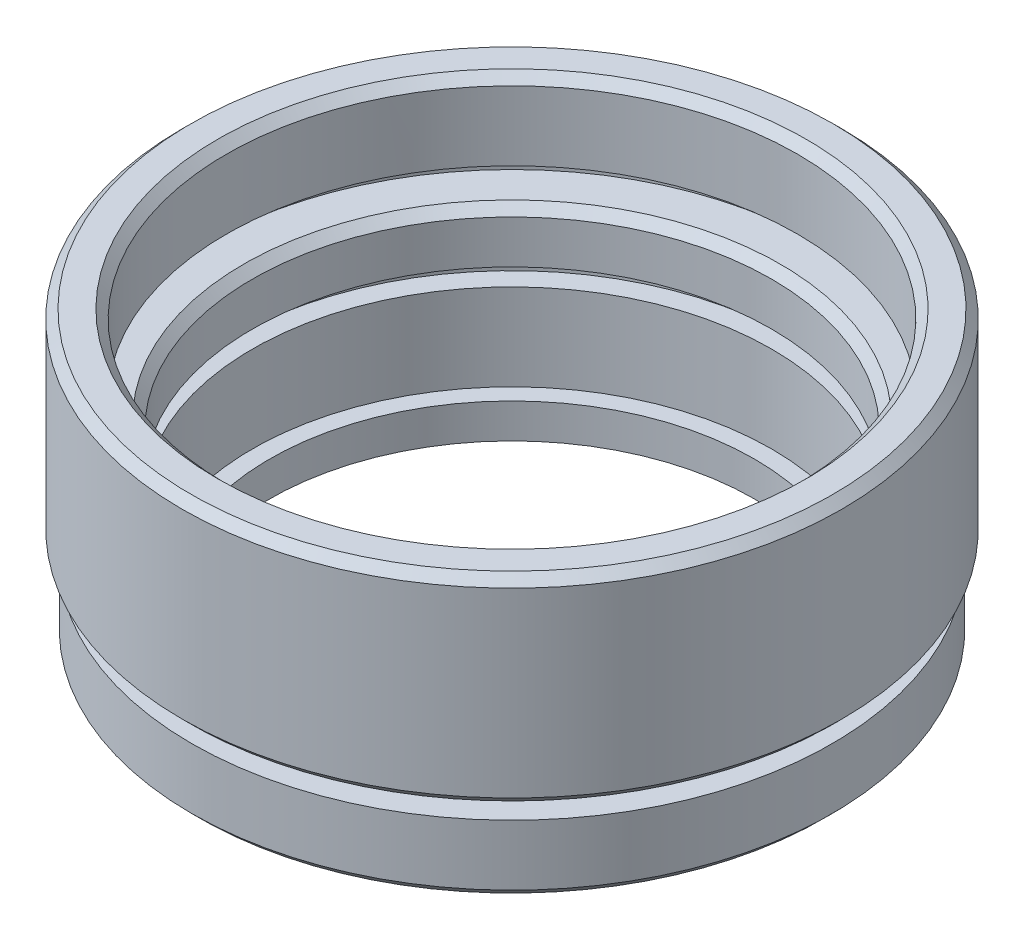
ISO-10303-21;
HEADER;
FILE_DESCRIPTION(('STEP AP214'),'2;1');
FILE_NAME('part.step','',(''),(''),'','','');
FILE_SCHEMA(('AUTOMOTIVE_DESIGN { 1 0 10303 214 1 1 1 1 }'));
ENDSEC;
DATA;
#1=APPLICATION_CONTEXT('core data for automotive mechanical design processes');
#2=APPLICATION_PROTOCOL_DEFINITION('international standard','automotive_design',2000,#1);
#3=PRODUCT_CONTEXT('',#1,'mechanical');
#4=PRODUCT('Part','Part','',(#3));
#5=PRODUCT_RELATED_PRODUCT_CATEGORY('part','',(#4));
#6=PRODUCT_DEFINITION_FORMATION('','',#4);
#7=PRODUCT_DEFINITION_CONTEXT('part definition',#1,'design');
#8=PRODUCT_DEFINITION('design','',#6,#7);
#9=PRODUCT_DEFINITION_SHAPE('','',#8);
#10=(LENGTH_UNIT() NAMED_UNIT(*) SI_UNIT(.MILLI.,.METRE.));
#11=(NAMED_UNIT(*) PLANE_ANGLE_UNIT() SI_UNIT($,.RADIAN.));
#12=(NAMED_UNIT(*) SI_UNIT($,.STERADIAN.) SOLID_ANGLE_UNIT());
#13=UNCERTAINTY_MEASURE_WITH_UNIT(LENGTH_MEASURE(1.E-05),#10,'distance_accuracy_value','');
#14=(GEOMETRIC_REPRESENTATION_CONTEXT(3) GLOBAL_UNCERTAINTY_ASSIGNED_CONTEXT((#13)) GLOBAL_UNIT_ASSIGNED_CONTEXT((#10,
#11,#12)) REPRESENTATION_CONTEXT('',''));
#15=CARTESIAN_POINT('',(0.,0.,0.));
#16=DIRECTION('',(0.,0.,1.));
#17=DIRECTION('',(1.,0.,0.));
#18=AXIS2_PLACEMENT_3D('',#15,#16,#17);
#19=CARTESIAN_POINT('',(16.5,16.5,0.));
#20=DIRECTION('',(0.,1.,0.));
#21=DIRECTION('',(0.,0.,1.));
#22=AXIS2_PLACEMENT_3D('',#19,#20,#21);
#23=PLANE('',#22);
#24=CARTESIAN_POINT('',(0.,16.5,0.));
#25=DIRECTION('',(0.,1.,0.));
#26=DIRECTION('',(0.,0.,1.));
#27=AXIS2_PLACEMENT_3D('',#24,#25,#26);
#28=CIRCLE('',#27,17.);
#29=CARTESIAN_POINT('',(0.,16.5,17.));
#30=VERTEX_POINT('',#29);
#31=EDGE_CURVE('E42',#30,#30,#28,.F.);
#32=ORIENTED_EDGE('',*,*,#31,.T.);
#33=EDGE_LOOP('',(#32));
#34=FACE_BOUND('',#33,.T.);
#35=CARTESIAN_POINT('',(0.,16.5,0.));
#36=DIRECTION('',(0.,-1.,0.));
#37=DIRECTION('',(0.,0.,-1.));
#38=AXIS2_PLACEMENT_3D('',#35,#36,#37);
#39=CIRCLE('',#38,18.55);
#40=CARTESIAN_POINT('',(0.,16.5,-18.55));
#41=VERTEX_POINT('',#40);
#42=EDGE_CURVE('E109',#41,#41,#39,.T.);
#43=ORIENTED_EDGE('',*,*,#42,.F.);
#44=EDGE_LOOP('',(#43));
#45=FACE_BOUND('',#44,.T.);
#46=ADVANCED_FACE('F35',(#34,#45),#23,.T.);
#47=CARTESIAN_POINT('',(0.,0.,0.));
#48=DIRECTION('',(0.,-1.,0.));
#49=DIRECTION('',(0.,0.,-1.));
#50=AXIS2_PLACEMENT_3D('',#47,#48,#49);
#51=CYLINDRICAL_SURFACE('',#50,16.5);
#52=CARTESIAN_POINT('',(0.,16.,0.));
#53=DIRECTION('',(0.,1.,0.));
#54=DIRECTION('',(0.,0.,1.));
#55=AXIS2_PLACEMENT_3D('',#52,#53,#54);
#56=CIRCLE('',#55,16.5);
#57=CARTESIAN_POINT('',(0.,16.,16.5));
#58=VERTEX_POINT('',#57);
#59=EDGE_CURVE('E10',#58,#58,#56,.T.);
#60=ORIENTED_EDGE('',*,*,#59,.T.);
#61=EDGE_LOOP('',(#60));
#62=FACE_BOUND('',#61,.T.);
#63=CARTESIAN_POINT('',(0.,12.,0.));
#64=DIRECTION('',(0.,-1.,0.));
#65=DIRECTION('',(0.,0.,-1.));
#66=AXIS2_PLACEMENT_3D('',#63,#64,#65);
#67=CIRCLE('',#66,16.5);
#68=CARTESIAN_POINT('',(0.,12.,-16.5));
#69=VERTEX_POINT('',#68);
#70=EDGE_CURVE('E55',#69,#69,#67,.T.);
#71=ORIENTED_EDGE('',*,*,#70,.T.);
#72=EDGE_LOOP('',(#71));
#73=FACE_BOUND('',#72,.T.);
#74=ADVANCED_FACE('F117',(#62,#73),#51,.F.);
#75=CARTESIAN_POINT('',(17.65,12.,0.));
#76=DIRECTION('',(0.,-1.,0.));
#77=DIRECTION('',(0.,0.,-1.));
#78=AXIS2_PLACEMENT_3D('',#75,#76,#77);
#79=PLANE('',#78);
#80=CARTESIAN_POINT('',(0.,12.,0.));
#81=DIRECTION('',(0.,-1.,0.));
#82=DIRECTION('',(0.,0.,-1.));
#83=AXIS2_PLACEMENT_3D('',#80,#81,#82);
#84=CIRCLE('',#83,17.65);
#85=CARTESIAN_POINT('',(0.,12.,-17.65));
#86=VERTEX_POINT('',#85);
#87=EDGE_CURVE('E58',#86,#86,#84,.T.);
#88=ORIENTED_EDGE('',*,*,#87,.T.);
#89=EDGE_LOOP('',(#88));
#90=FACE_BOUND('',#89,.T.);
#91=ORIENTED_EDGE('',*,*,#70,.F.);
#92=EDGE_LOOP('',(#91));
#93=FACE_BOUND('',#92,.T.);
#94=ADVANCED_FACE('F122',(#90,#93),#79,.T.);
#95=CARTESIAN_POINT('',(0.,0.,0.));
#96=DIRECTION('',(0.,-1.,0.));
#97=DIRECTION('',(0.,0.,-1.));
#98=AXIS2_PLACEMENT_3D('',#95,#96,#97);
#99=CYLINDRICAL_SURFACE('',#98,17.65);
#100=CARTESIAN_POINT('',(0.,11.,0.));
#101=DIRECTION('',(0.,-1.,0.));
#102=DIRECTION('',(0.,0.,-1.));
#103=AXIS2_PLACEMENT_3D('',#100,#101,#102);
#104=CIRCLE('',#103,17.65);
#105=CARTESIAN_POINT('',(0.,11.,-17.65));
#106=VERTEX_POINT('',#105);
#107=EDGE_CURVE('E61',#106,#106,#104,.T.);
#108=ORIENTED_EDGE('',*,*,#107,.T.);
#109=EDGE_LOOP('',(#108));
#110=FACE_BOUND('',#109,.T.);
#111=ORIENTED_EDGE('',*,*,#87,.F.);
#112=EDGE_LOOP('',(#111));
#113=FACE_BOUND('',#112,.T.);
#114=ADVANCED_FACE('F143',(#110,#113),#99,.F.);
#115=CARTESIAN_POINT('',(15.,11.,0.));
#116=DIRECTION('',(0.,1.,0.));
#117=DIRECTION('',(0.,0.,1.));
#118=AXIS2_PLACEMENT_3D('',#115,#116,#117);
#119=PLANE('',#118);
#120=CARTESIAN_POINT('',(0.,11.,0.));
#121=DIRECTION('',(0.,1.,0.));
#122=DIRECTION('',(0.,0.,1.));
#123=AXIS2_PLACEMENT_3D('',#120,#121,#122);
#124=CIRCLE('',#123,15.5);
#125=CARTESIAN_POINT('',(0.,11.,15.5));
#126=VERTEX_POINT('',#125);
#127=EDGE_CURVE('E50',#126,#126,#124,.F.);
#128=ORIENTED_EDGE('',*,*,#127,.T.);
#129=EDGE_LOOP('',(#128));
#130=FACE_BOUND('',#129,.T.);
#131=ORIENTED_EDGE('',*,*,#107,.F.);
#132=EDGE_LOOP('',(#131));
#133=FACE_BOUND('',#132,.T.);
#134=ADVANCED_FACE('F139',(#130,#133),#119,.T.);
#135=CARTESIAN_POINT('',(0.,0.,0.));
#136=DIRECTION('',(0.,-1.,0.));
#137=DIRECTION('',(0.,0.,-1.));
#138=AXIS2_PLACEMENT_3D('',#135,#136,#137);
#139=CYLINDRICAL_SURFACE('',#138,15.);
#140=CARTESIAN_POINT('',(0.,10.5,0.));
#141=DIRECTION('',(0.,1.,0.));
#142=DIRECTION('',(0.,0.,1.));
#143=AXIS2_PLACEMENT_3D('',#140,#141,#142);
#144=CIRCLE('',#143,15.);
#145=CARTESIAN_POINT('',(0.,10.5,15.));
#146=VERTEX_POINT('',#145);
#147=EDGE_CURVE('E46',#146,#146,#144,.T.);
#148=ORIENTED_EDGE('',*,*,#147,.T.);
#149=EDGE_LOOP('',(#148));
#150=FACE_BOUND('',#149,.T.);
#151=CARTESIAN_POINT('',(0.,8.,0.));
#152=DIRECTION('',(0.,-1.,0.));
#153=DIRECTION('',(0.,0.,-1.));
#154=AXIS2_PLACEMENT_3D('',#151,#152,#153);
#155=CIRCLE('',#154,15.);
#156=CARTESIAN_POINT('',(0.,8.,-15.));
#157=VERTEX_POINT('',#156);
#158=EDGE_CURVE('E64',#157,#157,#155,.T.);
#159=ORIENTED_EDGE('',*,*,#158,.T.);
#160=EDGE_LOOP('',(#159));
#161=FACE_BOUND('',#160,.T.);
#162=ADVANCED_FACE('F142',(#150,#161),#139,.F.);
#163=CARTESIAN_POINT('',(16.15,8.,0.));
#164=DIRECTION('',(0.,-1.,0.));
#165=DIRECTION('',(0.,0.,-1.));
#166=AXIS2_PLACEMENT_3D('',#163,#164,#165);
#167=PLANE('',#166);
#168=CARTESIAN_POINT('',(0.,8.,0.));
#169=DIRECTION('',(0.,-1.,0.));
#170=DIRECTION('',(0.,0.,-1.));
#171=AXIS2_PLACEMENT_3D('',#168,#169,#170);
#172=CIRCLE('',#171,16.15);
#173=CARTESIAN_POINT('',(0.,8.,-16.15));
#174=VERTEX_POINT('',#173);
#175=EDGE_CURVE('E67',#174,#174,#172,.T.);
#176=ORIENTED_EDGE('',*,*,#175,.T.);
#177=EDGE_LOOP('',(#176));
#178=FACE_BOUND('',#177,.T.);
#179=ORIENTED_EDGE('',*,*,#158,.F.);
#180=EDGE_LOOP('',(#179));
#181=FACE_BOUND('',#180,.T.);
#182=ADVANCED_FACE('F161',(#178,#181),#167,.T.);
#183=CARTESIAN_POINT('',(0.,0.,0.));
#184=DIRECTION('',(0.,-1.,0.));
#185=DIRECTION('',(0.,0.,-1.));
#186=AXIS2_PLACEMENT_3D('',#183,#184,#185);
#187=CYLINDRICAL_SURFACE('',#186,16.15);
#188=CARTESIAN_POINT('',(0.,7.,0.));
#189=DIRECTION('',(0.,-1.,0.));
#190=DIRECTION('',(0.,0.,-1.));
#191=AXIS2_PLACEMENT_3D('',#188,#189,#190);
#192=CIRCLE('',#191,16.15);
#193=CARTESIAN_POINT('',(0.,7.,-16.15));
#194=VERTEX_POINT('',#193);
#195=EDGE_CURVE('E70',#194,#194,#192,.T.);
#196=ORIENTED_EDGE('',*,*,#195,.T.);
#197=EDGE_LOOP('',(#196));
#198=FACE_BOUND('',#197,.T.);
#199=ORIENTED_EDGE('',*,*,#175,.F.);
#200=EDGE_LOOP('',(#199));
#201=FACE_BOUND('',#200,.T.);
#202=ADVANCED_FACE('F165',(#198,#201),#187,.F.);
#203=CARTESIAN_POINT('',(15.,7.,0.));
#204=DIRECTION('',(0.,1.,0.));
#205=DIRECTION('',(0.,0.,1.));
#206=AXIS2_PLACEMENT_3D('',#203,#204,#205);
#207=PLANE('',#206);
#208=CARTESIAN_POINT('',(0.,7.,0.));
#209=DIRECTION('',(0.,-1.,0.));
#210=DIRECTION('',(0.,0.,-1.));
#211=AXIS2_PLACEMENT_3D('',#208,#209,#210);
#212=CIRCLE('',#211,15.);
#213=CARTESIAN_POINT('',(0.,7.,-15.));
#214=VERTEX_POINT('',#213);
#215=EDGE_CURVE('E73',#214,#214,#212,.T.);
#216=ORIENTED_EDGE('',*,*,#215,.T.);
#217=EDGE_LOOP('',(#216));
#218=FACE_BOUND('',#217,.T.);
#219=ORIENTED_EDGE('',*,*,#195,.F.);
#220=EDGE_LOOP('',(#219));
#221=FACE_BOUND('',#220,.T.);
#222=ADVANCED_FACE('F169',(#218,#221),#207,.T.);
#223=CARTESIAN_POINT('',(0.,0.,0.));
#224=DIRECTION('',(0.,-1.,0.));
#225=DIRECTION('',(0.,0.,-1.));
#226=AXIS2_PLACEMENT_3D('',#223,#224,#225);
#227=CYLINDRICAL_SURFACE('',#226,15.);
#228=CARTESIAN_POINT('',(0.,2.,0.));
#229=DIRECTION('',(0.,-1.,0.));
#230=DIRECTION('',(0.,0.,-1.));
#231=AXIS2_PLACEMENT_3D('',#228,#229,#230);
#232=CIRCLE('',#231,15.);
#233=CARTESIAN_POINT('',(0.,2.,-15.));
#234=VERTEX_POINT('',#233);
#235=EDGE_CURVE('E76',#234,#234,#232,.T.);
#236=ORIENTED_EDGE('',*,*,#235,.T.);
#237=EDGE_LOOP('',(#236));
#238=FACE_BOUND('',#237,.T.);
#239=ORIENTED_EDGE('',*,*,#215,.F.);
#240=EDGE_LOOP('',(#239));
#241=FACE_BOUND('',#240,.T.);
#242=ADVANCED_FACE('F173',(#238,#241),#227,.F.);
#243=CARTESIAN_POINT('',(14.,2.,0.));
#244=DIRECTION('',(0.,1.,0.));
#245=DIRECTION('',(0.,0.,1.));
#246=AXIS2_PLACEMENT_3D('',#243,#244,#245);
#247=PLANE('',#246);
#248=CARTESIAN_POINT('',(0.,2.,0.));
#249=DIRECTION('',(0.,-1.,0.));
#250=DIRECTION('',(0.,0.,-1.));
#251=AXIS2_PLACEMENT_3D('',#248,#249,#250);
#252=CIRCLE('',#251,14.);
#253=CARTESIAN_POINT('',(0.,2.,-14.));
#254=VERTEX_POINT('',#253);
#255=EDGE_CURVE('E79',#254,#254,#252,.T.);
#256=ORIENTED_EDGE('',*,*,#255,.T.);
#257=EDGE_LOOP('',(#256));
#258=FACE_BOUND('',#257,.T.);
#259=ORIENTED_EDGE('',*,*,#235,.F.);
#260=EDGE_LOOP('',(#259));
#261=FACE_BOUND('',#260,.T.);
#262=ADVANCED_FACE('F177',(#258,#261),#247,.T.);
#263=CARTESIAN_POINT('',(0.,0.,0.));
#264=DIRECTION('',(0.,-1.,0.));
#265=DIRECTION('',(0.,0.,-1.));
#266=AXIS2_PLACEMENT_3D('',#263,#264,#265);
#267=CYLINDRICAL_SURFACE('',#266,14.);
#268=CARTESIAN_POINT('',(0.,0.,0.));
#269=DIRECTION('',(0.,-1.,0.));
#270=DIRECTION('',(0.,0.,-1.));
#271=AXIS2_PLACEMENT_3D('',#268,#269,#270);
#272=CIRCLE('',#271,14.);
#273=CARTESIAN_POINT('',(0.,0.,-14.));
#274=VERTEX_POINT('',#273);
#275=EDGE_CURVE('E82',#274,#274,#272,.T.);
#276=ORIENTED_EDGE('',*,*,#275,.T.);
#277=EDGE_LOOP('',(#276));
#278=FACE_BOUND('',#277,.T.);
#279=ORIENTED_EDGE('',*,*,#255,.F.);
#280=EDGE_LOOP('',(#279));
#281=FACE_BOUND('',#280,.T.);
#282=ADVANCED_FACE('F181',(#278,#281),#267,.F.);
#283=CARTESIAN_POINT('',(14.,0.,0.));
#284=DIRECTION('',(0.,-1.,0.));
#285=DIRECTION('',(0.,0.,-1.));
#286=AXIS2_PLACEMENT_3D('',#283,#284,#285);
#287=PLANE('',#286);
#288=CARTESIAN_POINT('',(0.,0.,0.));
#289=DIRECTION('',(0.,-1.,0.));
#290=DIRECTION('',(0.,0.,-1.));
#291=AXIS2_PLACEMENT_3D('',#288,#289,#290);
#292=CIRCLE('',#291,18.);
#293=CARTESIAN_POINT('',(0.,0.,-18.));
#294=VERTEX_POINT('',#293);
#295=EDGE_CURVE('E85',#294,#294,#292,.T.);
#296=ORIENTED_EDGE('',*,*,#295,.T.);
#297=EDGE_LOOP('',(#296));
#298=FACE_BOUND('',#297,.T.);
#299=ORIENTED_EDGE('',*,*,#275,.F.);
#300=EDGE_LOOP('',(#299));
#301=FACE_BOUND('',#300,.T.);
#302=ADVANCED_FACE('F185',(#298,#301),#287,.T.);
#303=CARTESIAN_POINT('',(0.,0.,0.));
#304=DIRECTION('',(0.,1.,0.));
#305=DIRECTION('',(0.,0.,1.));
#306=AXIS2_PLACEMENT_3D('',#303,#304,#305);
#307=CONICAL_SURFACE('',#306,18.,0.785398163397451);
#308=CARTESIAN_POINT('',(0.,0.499999999999998,0.));
#309=DIRECTION('',(0.,-1.,0.));
#310=DIRECTION('',(0.,0.,-1.));
#311=AXIS2_PLACEMENT_3D('',#308,#309,#310);
#312=CIRCLE('',#311,18.5);
#313=CARTESIAN_POINT('',(0.,0.499999999999998,-18.5));
#314=VERTEX_POINT('',#313);
#315=EDGE_CURVE('E88',#314,#314,#312,.T.);
#316=ORIENTED_EDGE('',*,*,#315,.T.);
#317=EDGE_LOOP('',(#316));
#318=FACE_BOUND('',#317,.T.);
#319=ORIENTED_EDGE('',*,*,#295,.F.);
#320=EDGE_LOOP('',(#319));
#321=FACE_BOUND('',#320,.T.);
#322=ADVANCED_FACE('F189',(#318,#321),#307,.T.);
#323=CARTESIAN_POINT('',(0.,0.,0.));
#324=DIRECTION('',(0.,-1.,0.));
#325=DIRECTION('',(0.,0.,-1.));
#326=AXIS2_PLACEMENT_3D('',#323,#324,#325);
#327=CYLINDRICAL_SURFACE('',#326,18.5);
#328=CARTESIAN_POINT('',(0.,4.,0.));
#329=DIRECTION('',(0.,-1.,0.));
#330=DIRECTION('',(0.,0.,-1.));
#331=AXIS2_PLACEMENT_3D('',#328,#329,#330);
#332=CIRCLE('',#331,18.5);
#333=CARTESIAN_POINT('',(0.,4.,-18.5));
#334=VERTEX_POINT('',#333);
#335=EDGE_CURVE('E91',#334,#334,#332,.T.);
#336=ORIENTED_EDGE('',*,*,#335,.T.);
#337=EDGE_LOOP('',(#336));
#338=FACE_BOUND('',#337,.T.);
#339=ORIENTED_EDGE('',*,*,#315,.F.);
#340=EDGE_LOOP('',(#339));
#341=FACE_BOUND('',#340,.T.);
#342=ADVANCED_FACE('F193',(#338,#341),#327,.T.);
#343=CARTESIAN_POINT('',(18.5,4.,0.));
#344=DIRECTION('',(0.,1.,0.));
#345=DIRECTION('',(0.,0.,1.));
#346=AXIS2_PLACEMENT_3D('',#343,#344,#345);
#347=PLANE('',#346);
#348=CARTESIAN_POINT('',(0.,4.,0.));
#349=DIRECTION('',(0.,-1.,0.));
#350=DIRECTION('',(0.,0.,-1.));
#351=AXIS2_PLACEMENT_3D('',#348,#349,#350);
#352=CIRCLE('',#351,17.);
#353=CARTESIAN_POINT('',(0.,4.,-17.));
#354=VERTEX_POINT('',#353);
#355=EDGE_CURVE('E94',#354,#354,#352,.T.);
#356=ORIENTED_EDGE('',*,*,#355,.T.);
#357=EDGE_LOOP('',(#356));
#358=FACE_BOUND('',#357,.T.);
#359=ORIENTED_EDGE('',*,*,#335,.F.);
#360=EDGE_LOOP('',(#359));
#361=FACE_BOUND('',#360,.T.);
#362=ADVANCED_FACE('F197',(#358,#361),#347,.T.);
#363=CARTESIAN_POINT('',(0.,0.,0.));
#364=DIRECTION('',(0.,-1.,0.));
#365=DIRECTION('',(0.,0.,-1.));
#366=AXIS2_PLACEMENT_3D('',#363,#364,#365);
#367=CYLINDRICAL_SURFACE('',#366,17.);
#368=CARTESIAN_POINT('',(0.,5.,0.));
#369=DIRECTION('',(0.,-1.,0.));
#370=DIRECTION('',(0.,0.,-1.));
#371=AXIS2_PLACEMENT_3D('',#368,#369,#370);
#372=CIRCLE('',#371,17.);
#373=CARTESIAN_POINT('',(0.,5.,-17.));
#374=VERTEX_POINT('',#373);
#375=EDGE_CURVE('E97',#374,#374,#372,.T.);
#376=ORIENTED_EDGE('',*,*,#375,.T.);
#377=EDGE_LOOP('',(#376));
#378=FACE_BOUND('',#377,.T.);
#379=ORIENTED_EDGE('',*,*,#355,.F.);
#380=EDGE_LOOP('',(#379));
#381=FACE_BOUND('',#380,.T.);
#382=ADVANCED_FACE('F201',(#378,#381),#367,.T.);
#383=CARTESIAN_POINT('',(17.,5.,0.));
#384=DIRECTION('',(0.,-1.,0.));
#385=DIRECTION('',(0.,0.,-1.));
#386=AXIS2_PLACEMENT_3D('',#383,#384,#385);
#387=PLANE('',#386);
#388=CARTESIAN_POINT('',(0.,5.,0.));
#389=DIRECTION('',(0.,-1.,0.));
#390=DIRECTION('',(0.,0.,-1.));
#391=AXIS2_PLACEMENT_3D('',#388,#389,#390);
#392=CIRCLE('',#391,18.55);
#393=CARTESIAN_POINT('',(0.,5.,-18.55));
#394=VERTEX_POINT('',#393);
#395=EDGE_CURVE('E100',#394,#394,#392,.T.);
#396=ORIENTED_EDGE('',*,*,#395,.T.);
#397=EDGE_LOOP('',(#396));
#398=FACE_BOUND('',#397,.T.);
#399=ORIENTED_EDGE('',*,*,#375,.F.);
#400=EDGE_LOOP('',(#399));
#401=FACE_BOUND('',#400,.T.);
#402=ADVANCED_FACE('F205',(#398,#401),#387,.T.);
#403=CARTESIAN_POINT('',(0.,5.,0.));
#404=DIRECTION('',(0.,1.,0.));
#405=DIRECTION('',(0.,0.,1.));
#406=AXIS2_PLACEMENT_3D('',#403,#404,#405);
#407=CONICAL_SURFACE('',#406,18.55,0.785398163397451);
#408=CARTESIAN_POINT('',(0.,5.5,0.));
#409=DIRECTION('',(0.,-1.,0.));
#410=DIRECTION('',(0.,0.,-1.));
#411=AXIS2_PLACEMENT_3D('',#408,#409,#410);
#412=CIRCLE('',#411,19.05);
#413=CARTESIAN_POINT('',(0.,5.5,-19.05));
#414=VERTEX_POINT('',#413);
#415=EDGE_CURVE('E103',#414,#414,#412,.T.);
#416=ORIENTED_EDGE('',*,*,#415,.T.);
#417=EDGE_LOOP('',(#416));
#418=FACE_BOUND('',#417,.T.);
#419=ORIENTED_EDGE('',*,*,#395,.F.);
#420=EDGE_LOOP('',(#419));
#421=FACE_BOUND('',#420,.T.);
#422=ADVANCED_FACE('F209',(#418,#421),#407,.T.);
#423=CARTESIAN_POINT('',(0.,0.,0.));
#424=DIRECTION('',(0.,-1.,0.));
#425=DIRECTION('',(0.,0.,-1.));
#426=AXIS2_PLACEMENT_3D('',#423,#424,#425);
#427=CYLINDRICAL_SURFACE('',#426,19.05);
#428=CARTESIAN_POINT('',(0.,16.,0.));
#429=DIRECTION('',(0.,-1.,0.));
#430=DIRECTION('',(0.,0.,-1.));
#431=AXIS2_PLACEMENT_3D('',#428,#429,#430);
#432=CIRCLE('',#431,19.05);
#433=CARTESIAN_POINT('',(0.,16.,-19.05));
#434=VERTEX_POINT('',#433);
#435=EDGE_CURVE('E106',#434,#434,#432,.T.);
#436=ORIENTED_EDGE('',*,*,#435,.T.);
#437=EDGE_LOOP('',(#436));
#438=FACE_BOUND('',#437,.T.);
#439=ORIENTED_EDGE('',*,*,#415,.F.);
#440=EDGE_LOOP('',(#439));
#441=FACE_BOUND('',#440,.T.);
#442=ADVANCED_FACE('F133',(#438,#441),#427,.T.);
#443=CARTESIAN_POINT('',(0.,16.,0.));
#444=DIRECTION('',(0.,-1.,0.));
#445=DIRECTION('',(0.,0.,-1.));
#446=AXIS2_PLACEMENT_3D('',#443,#444,#445);
#447=CONICAL_SURFACE('',#446,19.05,0.785398163397445);
#448=ORIENTED_EDGE('',*,*,#42,.T.);
#449=EDGE_LOOP('',(#448));
#450=FACE_BOUND('',#449,.T.);
#451=ORIENTED_EDGE('',*,*,#435,.F.);
#452=EDGE_LOOP('',(#451));
#453=FACE_BOUND('',#452,.T.);
#454=ADVANCED_FACE('F113',(#450,#453),#447,.T.);
#455=CARTESIAN_POINT('',(0.,11.,0.));
#456=DIRECTION('',(0.,1.,0.));
#457=DIRECTION('',(0.,0.,1.));
#458=AXIS2_PLACEMENT_3D('',#455,#456,#457);
#459=CONICAL_SURFACE('',#458,15.5,0.785398163397443);
#460=ORIENTED_EDGE('',*,*,#147,.F.);
#461=EDGE_LOOP('',(#460));
#462=FACE_BOUND('',#461,.T.);
#463=ORIENTED_EDGE('',*,*,#127,.F.);
#464=EDGE_LOOP('',(#463));
#465=FACE_BOUND('',#464,.T.);
#466=ADVANCED_FACE('F125',(#462,#465),#459,.F.);
#467=CARTESIAN_POINT('',(0.,16.5,0.));
#468=DIRECTION('',(0.,1.,0.));
#469=DIRECTION('',(0.,0.,1.));
#470=AXIS2_PLACEMENT_3D('',#467,#468,#469);
#471=CONICAL_SURFACE('',#470,17.,0.785398163397448);
#472=ORIENTED_EDGE('',*,*,#59,.F.);
#473=EDGE_LOOP('',(#472));
#474=FACE_BOUND('',#473,.T.);
#475=ORIENTED_EDGE('',*,*,#31,.F.);
#476=EDGE_LOOP('',(#475));
#477=FACE_BOUND('',#476,.T.);
#478=ADVANCED_FACE('F37',(#474,#477),#471,.F.);
#479=CLOSED_SHELL('',(#46,#74,#94,#114,#134,#162,#182,#202,#222,#242,#262,#282,#302,#322,#342,
#362,#382,#402,#422,#442,#454,#466,#478));
#480=MANIFOLD_SOLID_BREP('B2',#479);
#481=ADVANCED_BREP_SHAPE_REPRESENTATION('',(#18,#480),#14);
#482=SHAPE_DEFINITION_REPRESENTATION(#9,#481);
ENDSEC;
END-ISO-10303-21;
